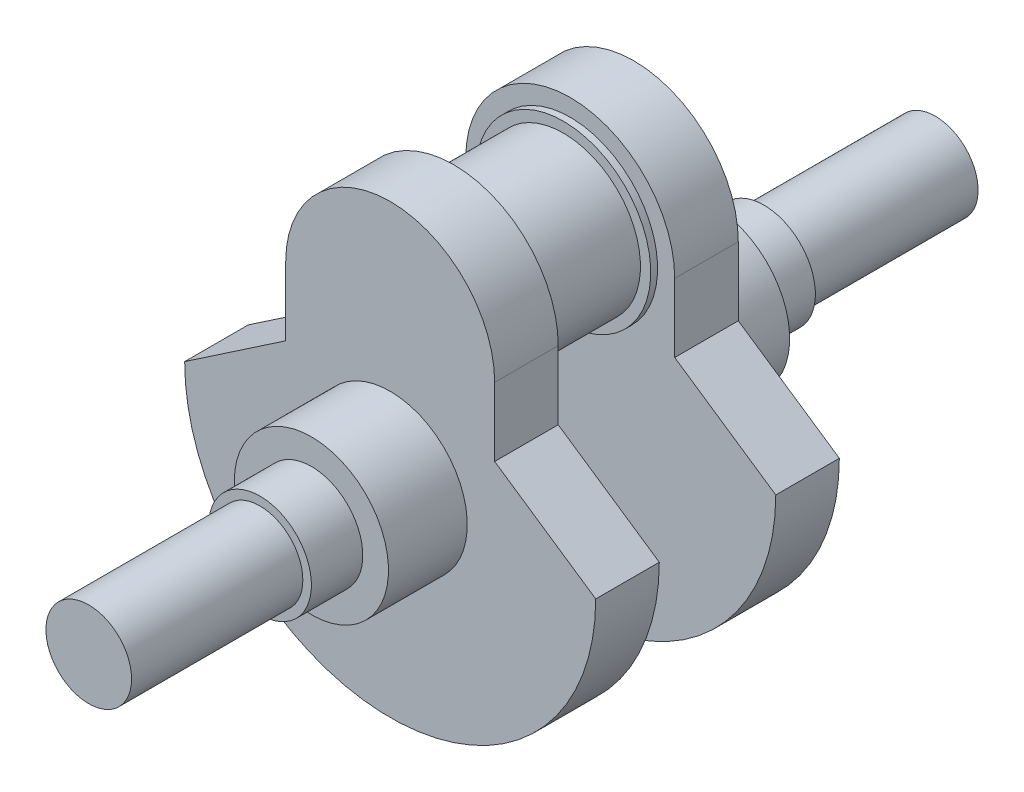
ISO-10303-21;
HEADER;
FILE_DESCRIPTION(('STEP AP214'),'2;1');
FILE_NAME('part.step','',(''),(''),'','','');
FILE_SCHEMA(('AUTOMOTIVE_DESIGN { 1 0 10303 214 1 1 1 1 }'));
ENDSEC;
DATA;
#1=APPLICATION_CONTEXT('core data for automotive mechanical design processes');
#2=APPLICATION_PROTOCOL_DEFINITION('international standard','automotive_design',2000,#1);
#3=PRODUCT_CONTEXT('',#1,'mechanical');
#4=PRODUCT('Part','Part','',(#3));
#5=PRODUCT_RELATED_PRODUCT_CATEGORY('part','',(#4));
#6=PRODUCT_DEFINITION_FORMATION('','',#4);
#7=PRODUCT_DEFINITION_CONTEXT('part definition',#1,'design');
#8=PRODUCT_DEFINITION('design','',#6,#7);
#9=PRODUCT_DEFINITION_SHAPE('','',#8);
#10=(LENGTH_UNIT() NAMED_UNIT(*) SI_UNIT(.MILLI.,.METRE.));
#11=(NAMED_UNIT(*) PLANE_ANGLE_UNIT() SI_UNIT($,.RADIAN.));
#12=(NAMED_UNIT(*) SI_UNIT($,.STERADIAN.) SOLID_ANGLE_UNIT());
#13=UNCERTAINTY_MEASURE_WITH_UNIT(LENGTH_MEASURE(1.E-05),#10,'distance_accuracy_value','');
#14=(GEOMETRIC_REPRESENTATION_CONTEXT(3) GLOBAL_UNCERTAINTY_ASSIGNED_CONTEXT((#13)) GLOBAL_UNIT_ASSIGNED_CONTEXT((#10,
#11,#12)) REPRESENTATION_CONTEXT('',''));
#15=CARTESIAN_POINT('',(0.,0.,0.));
#16=DIRECTION('',(0.,0.,1.));
#17=DIRECTION('',(1.,0.,0.));
#18=AXIS2_PLACEMENT_3D('',#15,#16,#17);
#19=CARTESIAN_POINT('',(0.,0.,-88.));
#20=DIRECTION('',(0.,0.,1.));
#21=DIRECTION('',(1.,0.,0.));
#22=AXIS2_PLACEMENT_3D('',#19,#20,#21);
#23=CYLINDRICAL_SURFACE('',#22,22.5);
#24=CARTESIAN_POINT('',(0.,0.,-65.));
#25=DIRECTION('',(0.,0.,-1.));
#26=DIRECTION('',(-1.,0.,0.));
#27=AXIS2_PLACEMENT_3D('',#24,#25,#26);
#28=CIRCLE('',#27,22.5);
#29=CARTESIAN_POINT('',(-22.5,0.,-65.));
#30=VERTEX_POINT('',#29);
#31=EDGE_CURVE('E144',#30,#30,#28,.T.);
#32=ORIENTED_EDGE('',*,*,#31,.T.);
#33=EDGE_LOOP('',(#32));
#34=FACE_BOUND('',#33,.T.);
#35=CARTESIAN_POINT('',(0.,0.,-88.));
#36=DIRECTION('',(0.,0.,-1.));
#37=DIRECTION('',(-1.,0.,0.));
#38=AXIS2_PLACEMENT_3D('',#35,#36,#37);
#39=CIRCLE('',#38,22.5);
#40=CARTESIAN_POINT('',(-22.5,0.,-88.));
#41=VERTEX_POINT('',#40);
#42=EDGE_CURVE('E53',#41,#41,#39,.T.);
#43=ORIENTED_EDGE('',*,*,#42,.F.);
#44=EDGE_LOOP('',(#43));
#45=FACE_BOUND('',#44,.T.);
#46=ADVANCED_FACE('F49',(#34,#45),#23,.T.);
#47=CARTESIAN_POINT('',(0.,0.,-50.));
#48=DIRECTION('',(0.,0.,1.));
#49=DIRECTION('',(1.,0.,0.));
#50=AXIS2_PLACEMENT_3D('',#47,#48,#49);
#51=CYLINDRICAL_SURFACE('',#50,12.5);
#52=CARTESIAN_POINT('',(0.,0.,-50.));
#53=DIRECTION('',(0.,0.,1.));
#54=DIRECTION('',(1.,0.,0.));
#55=AXIS2_PLACEMENT_3D('',#52,#53,#54);
#56=CIRCLE('',#55,12.5);
#57=CARTESIAN_POINT('',(12.5,0.,-50.));
#58=VERTEX_POINT('',#57);
#59=EDGE_CURVE('E151',#58,#58,#56,.T.);
#60=ORIENTED_EDGE('',*,*,#59,.T.);
#61=EDGE_LOOP('',(#60));
#62=FACE_BOUND('',#61,.T.);
#63=CARTESIAN_POINT('',(0.,0.,0.));
#64=DIRECTION('',(0.,0.,1.));
#65=DIRECTION('',(1.,0.,0.));
#66=AXIS2_PLACEMENT_3D('',#63,#64,#65);
#67=CIRCLE('',#66,12.5);
#68=CARTESIAN_POINT('',(12.5,0.,0.));
#69=VERTEX_POINT('',#68);
#70=EDGE_CURVE('E155',#69,#69,#67,.T.);
#71=ORIENTED_EDGE('',*,*,#70,.F.);
#72=EDGE_LOOP('',(#71));
#73=FACE_BOUND('',#72,.T.);
#74=ADVANCED_FACE('F51',(#62,#73),#51,.T.);
#75=CARTESIAN_POINT('',(0.,0.,0.));
#76=DIRECTION('',(0.,0.,1.));
#77=DIRECTION('',(1.,0.,0.));
#78=AXIS2_PLACEMENT_3D('',#75,#76,#77);
#79=PLANE('',#78);
#80=ORIENTED_EDGE('',*,*,#70,.T.);
#81=EDGE_LOOP('',(#80));
#82=FACE_BOUND('',#81,.T.);
#83=ADVANCED_FACE('F211',(#82),#79,.T.);
#84=CARTESIAN_POINT('',(0.,0.,-65.));
#85=DIRECTION('',(0.,0.,1.));
#86=DIRECTION('',(1.,0.,0.));
#87=AXIS2_PLACEMENT_3D('',#84,#85,#86);
#88=CYLINDRICAL_SURFACE('',#87,15.);
#89=CARTESIAN_POINT('',(0.,0.,-65.));
#90=DIRECTION('',(0.,0.,-1.));
#91=DIRECTION('',(-1.,0.,0.));
#92=AXIS2_PLACEMENT_3D('',#89,#90,#91);
#93=CIRCLE('',#92,15.);
#94=CARTESIAN_POINT('',(-15.,0.,-65.));
#95=VERTEX_POINT('',#94);
#96=EDGE_CURVE('E148',#95,#95,#93,.T.);
#97=ORIENTED_EDGE('',*,*,#96,.F.);
#98=EDGE_LOOP('',(#97));
#99=FACE_BOUND('',#98,.T.);
#100=CARTESIAN_POINT('',(0.,0.,-50.));
#101=DIRECTION('',(0.,0.,-1.));
#102=DIRECTION('',(-1.,0.,0.));
#103=AXIS2_PLACEMENT_3D('',#100,#101,#102);
#104=CIRCLE('',#103,15.);
#105=CARTESIAN_POINT('',(-15.,0.,-50.));
#106=VERTEX_POINT('',#105);
#107=EDGE_CURVE('E147',#106,#106,#104,.T.);
#108=ORIENTED_EDGE('',*,*,#107,.T.);
#109=EDGE_LOOP('',(#108));
#110=FACE_BOUND('',#109,.T.);
#111=ADVANCED_FACE('F221',(#99,#110),#88,.T.);
#112=CARTESIAN_POINT('',(0.,0.,-50.));
#113=DIRECTION('',(0.,0.,-1.));
#114=DIRECTION('',(-1.,0.,0.));
#115=AXIS2_PLACEMENT_3D('',#112,#113,#114);
#116=PLANE('',#115);
#117=ORIENTED_EDGE('',*,*,#59,.F.);
#118=EDGE_LOOP('',(#117));
#119=FACE_BOUND('',#118,.T.);
#120=ORIENTED_EDGE('',*,*,#107,.F.);
#121=EDGE_LOOP('',(#120));
#122=FACE_BOUND('',#121,.T.);
#123=ADVANCED_FACE('F218',(#119,#122),#116,.F.);
#124=CARTESIAN_POINT('',(0.,0.,-65.));
#125=DIRECTION('',(0.,0.,-1.));
#126=DIRECTION('',(-1.,0.,0.));
#127=AXIS2_PLACEMENT_3D('',#124,#125,#126);
#128=PLANE('',#127);
#129=ORIENTED_EDGE('',*,*,#96,.T.);
#130=EDGE_LOOP('',(#129));
#131=FACE_BOUND('',#130,.T.);
#132=ORIENTED_EDGE('',*,*,#31,.F.);
#133=EDGE_LOOP('',(#132));
#134=FACE_BOUND('',#133,.T.);
#135=ADVANCED_FACE('F216',(#131,#134),#128,.F.);
#136=CARTESIAN_POINT('',(-30.5,0.,-106.56));
#137=DIRECTION('',(-1.,0.,0.));
#138=DIRECTION('',(0.,0.,1.));
#139=AXIS2_PLACEMENT_3D('',#136,#137,#138);
#140=PLANE('',#139);
#141=DIRECTION('',(0.,-1.,0.));
#142=VECTOR('',#141,1.);
#143=CARTESIAN_POINT('',(-30.5,0.,-88.));
#144=LINE('',#143,#142);
#145=CARTESIAN_POINT('',(-30.5,40.,-88.));
#146=VERTEX_POINT('',#145);
#147=CARTESIAN_POINT('',(-30.5,20.,-88.));
#148=VERTEX_POINT('',#147);
#149=EDGE_CURVE('E181',#146,#148,#144,.T.);
#150=ORIENTED_EDGE('',*,*,#149,.F.);
#151=DIRECTION('',(0.,0.,1.));
#152=VECTOR('',#151,1.);
#153=CARTESIAN_POINT('',(-30.5,40.,-106.56));
#154=LINE('',#153,#152);
#155=CARTESIAN_POINT('',(-30.5,40.,-106.56));
#156=VERTEX_POINT('',#155);
#157=EDGE_CURVE('E99',#156,#146,#154,.T.);
#158=ORIENTED_EDGE('',*,*,#157,.F.);
#159=DIRECTION('',(0.,-1.,0.));
#160=VECTOR('',#159,1.);
#161=CARTESIAN_POINT('',(-30.5,0.,-106.56));
#162=LINE('',#161,#160);
#163=CARTESIAN_POINT('',(-30.5,20.,-106.56));
#164=VERTEX_POINT('',#163);
#165=EDGE_CURVE('E174',#156,#164,#162,.T.);
#166=ORIENTED_EDGE('',*,*,#165,.T.);
#167=DIRECTION('',(0.,0.,1.));
#168=VECTOR('',#167,1.);
#169=CARTESIAN_POINT('',(-30.5,20.,-106.56));
#170=LINE('',#169,#168);
#171=EDGE_CURVE('E68',#164,#148,#170,.T.);
#172=ORIENTED_EDGE('',*,*,#171,.T.);
#173=EDGE_LOOP('',(#150,#158,#166,#172));
#174=FACE_BOUND('',#173,.T.);
#175=ADVANCED_FACE('F244',(#174),#140,.T.);
#176=CARTESIAN_POINT('',(0.,40.,-106.56));
#177=DIRECTION('',(0.,0.,1.));
#178=DIRECTION('',(1.,0.,0.));
#179=AXIS2_PLACEMENT_3D('',#176,#177,#178);
#180=CYLINDRICAL_SURFACE('',#179,30.5);
#181=CARTESIAN_POINT('',(0.,40.,-88.));
#182=DIRECTION('',(0.,0.,-1.));
#183=DIRECTION('',(-1.,0.,0.));
#184=AXIS2_PLACEMENT_3D('',#181,#182,#183);
#185=CIRCLE('',#184,30.5);
#186=CARTESIAN_POINT('',(30.5,40.,-88.));
#187=VERTEX_POINT('',#186);
#188=EDGE_CURVE('E183',#146,#187,#185,.T.);
#189=ORIENTED_EDGE('',*,*,#188,.T.);
#190=DIRECTION('',(0.,0.,1.));
#191=VECTOR('',#190,1.);
#192=CARTESIAN_POINT('',(30.5,40.,-106.56));
#193=LINE('',#192,#191);
#194=CARTESIAN_POINT('',(30.5,40.,-106.56));
#195=VERTEX_POINT('',#194);
#196=EDGE_CURVE('E136',#195,#187,#193,.T.);
#197=ORIENTED_EDGE('',*,*,#196,.F.);
#198=CARTESIAN_POINT('',(0.,40.,-106.56));
#199=DIRECTION('',(0.,0.,-1.));
#200=DIRECTION('',(-1.,0.,0.));
#201=AXIS2_PLACEMENT_3D('',#198,#199,#200);
#202=CIRCLE('',#201,30.5);
#203=EDGE_CURVE('E176',#156,#195,#202,.T.);
#204=ORIENTED_EDGE('',*,*,#203,.F.);
#205=ORIENTED_EDGE('',*,*,#157,.T.);
#206=EDGE_LOOP('',(#189,#197,#204,#205));
#207=FACE_BOUND('',#206,.T.);
#208=ADVANCED_FACE('F251',(#207),#180,.T.);
#209=CARTESIAN_POINT('',(30.5,0.,-106.56));
#210=DIRECTION('',(-1.,0.,0.));
#211=DIRECTION('',(0.,-1.,0.));
#212=AXIS2_PLACEMENT_3D('',#209,#210,#211);
#213=PLANE('',#212);
#214=DIRECTION('',(0.,-1.,0.));
#215=VECTOR('',#214,1.);
#216=CARTESIAN_POINT('',(30.5,0.,-88.));
#217=LINE('',#216,#215);
#218=CARTESIAN_POINT('',(30.5,20.,-88.));
#219=VERTEX_POINT('',#218);
#220=EDGE_CURVE('E186',#187,#219,#217,.T.);
#221=ORIENTED_EDGE('',*,*,#220,.T.);
#222=DIRECTION('',(0.,0.,1.));
#223=VECTOR('',#222,1.);
#224=CARTESIAN_POINT('',(30.5,20.,-106.56));
#225=LINE('',#224,#223);
#226=CARTESIAN_POINT('',(30.5,20.,-106.56));
#227=VERTEX_POINT('',#226);
#228=EDGE_CURVE('E134',#227,#219,#225,.T.);
#229=ORIENTED_EDGE('',*,*,#228,.F.);
#230=DIRECTION('',(0.,-1.,0.));
#231=VECTOR('',#230,1.);
#232=CARTESIAN_POINT('',(30.5,0.,-106.56));
#233=LINE('',#232,#231);
#234=EDGE_CURVE('E127',#195,#227,#233,.T.);
#235=ORIENTED_EDGE('',*,*,#234,.F.);
#236=ORIENTED_EDGE('',*,*,#196,.T.);
#237=EDGE_LOOP('',(#221,#229,#235,#236));
#238=FACE_BOUND('',#237,.T.);
#239=ADVANCED_FACE('F258',(#238),#213,.F.);
#240=CARTESIAN_POINT('',(18.8964507759631,27.8680132286295,-106.56));
#241=DIRECTION('',(-0.561216953061736,-0.827668733006208,0.));
#242=DIRECTION('',(0.827668733006208,-0.561216953061736,0.));
#243=AXIS2_PLACEMENT_3D('',#240,#241,#242);
#244=PLANE('',#243);
#245=DIRECTION('',(0.827668733006208,-0.561216953061736,0.));
#246=VECTOR('',#245,1.);
#247=CARTESIAN_POINT('',(18.8964507759631,27.8680132286295,-88.));
#248=LINE('',#247,#246);
#249=CARTESIAN_POINT('',(59.9999999224164,-0.0030512348178878,-88.));
#250=VERTEX_POINT('',#249);
#251=EDGE_CURVE('E133',#219,#250,#248,.T.);
#252=ORIENTED_EDGE('',*,*,#251,.T.);
#253=DIRECTION('',(0.,0.,1.));
#254=VECTOR('',#253,1.);
#255=CARTESIAN_POINT('',(59.9999999224164,-0.0030512348178878,-106.56));
#256=LINE('',#255,#254);
#257=CARTESIAN_POINT('',(59.9999999224164,-0.0030512348178878,-106.56));
#258=VERTEX_POINT('',#257);
#259=EDGE_CURVE('E116',#258,#250,#256,.T.);
#260=ORIENTED_EDGE('',*,*,#259,.F.);
#261=DIRECTION('',(0.827668733006208,-0.561216953061736,0.));
#262=VECTOR('',#261,1.);
#263=CARTESIAN_POINT('',(18.8964507759631,27.8680132286295,-106.56));
#264=LINE('',#263,#262);
#265=EDGE_CURVE('E121',#227,#258,#264,.T.);
#266=ORIENTED_EDGE('',*,*,#265,.F.);
#267=ORIENTED_EDGE('',*,*,#228,.T.);
#268=EDGE_LOOP('',(#252,#260,#266,#267));
#269=FACE_BOUND('',#268,.T.);
#270=ADVANCED_FACE('F132',(#269),#244,.F.);
#271=CARTESIAN_POINT('',(0.,0.,-106.56));
#272=DIRECTION('',(0.,0.,1.));
#273=DIRECTION('',(1.,0.,0.));
#274=AXIS2_PLACEMENT_3D('',#271,#272,#273);
#275=CYLINDRICAL_SURFACE('',#274,60.);
#276=CARTESIAN_POINT('',(0.,0.,-88.));
#277=DIRECTION('',(0.,0.,-1.));
#278=DIRECTION('',(-1.,0.,0.));
#279=AXIS2_PLACEMENT_3D('',#276,#277,#278);
#280=CIRCLE('',#279,60.);
#281=CARTESIAN_POINT('',(-60.,0.,-88.));
#282=VERTEX_POINT('',#281);
#283=EDGE_CURVE('E190',#250,#282,#280,.T.);
#284=ORIENTED_EDGE('',*,*,#283,.T.);
#285=DIRECTION('',(0.,0.,1.));
#286=VECTOR('',#285,1.);
#287=CARTESIAN_POINT('',(-60.,0.,-106.56));
#288=LINE('',#287,#286);
#289=CARTESIAN_POINT('',(-60.,0.,-106.56));
#290=VERTEX_POINT('',#289);
#291=EDGE_CURVE('E90',#290,#282,#288,.T.);
#292=ORIENTED_EDGE('',*,*,#291,.F.);
#293=CARTESIAN_POINT('',(0.,0.,-106.56));
#294=DIRECTION('',(0.,0.,-1.));
#295=DIRECTION('',(-1.,0.,0.));
#296=AXIS2_PLACEMENT_3D('',#293,#294,#295);
#297=CIRCLE('',#296,60.);
#298=EDGE_CURVE('E112',#258,#290,#297,.T.);
#299=ORIENTED_EDGE('',*,*,#298,.F.);
#300=ORIENTED_EDGE('',*,*,#259,.T.);
#301=EDGE_LOOP('',(#284,#292,#299,#300));
#302=FACE_BOUND('',#301,.T.);
#303=ADVANCED_FACE('F114',(#302),#275,.T.);
#304=CARTESIAN_POINT('',(-18.8939185199764,27.8685298169652,-106.56));
#305=DIRECTION('',(-0.56115830386764,0.827708498204769,0.));
#306=DIRECTION('',(-0.827708498204769,-0.56115830386764,0.));
#307=AXIS2_PLACEMENT_3D('',#304,#305,#306);
#308=PLANE('',#307);
#309=DIRECTION('',(-0.827708498204769,-0.56115830386764,0.));
#310=VECTOR('',#309,1.);
#311=CARTESIAN_POINT('',(-18.8939185199764,27.8685298169652,-88.));
#312=LINE('',#311,#310);
#313=EDGE_CURVE('E177',#148,#282,#312,.T.);
#314=ORIENTED_EDGE('',*,*,#313,.F.);
#315=ORIENTED_EDGE('',*,*,#171,.F.);
#316=DIRECTION('',(-0.827708498204769,-0.56115830386764,0.));
#317=VECTOR('',#316,1.);
#318=CARTESIAN_POINT('',(-18.8939185199764,27.8685298169652,-106.56));
#319=LINE('',#318,#317);
#320=EDGE_CURVE('E120',#164,#290,#319,.T.);
#321=ORIENTED_EDGE('',*,*,#320,.T.);
#322=ORIENTED_EDGE('',*,*,#291,.T.);
#323=EDGE_LOOP('',(#314,#315,#321,#322));
#324=FACE_BOUND('',#323,.T.);
#325=ADVANCED_FACE('F196',(#324),#308,.T.);
#326=CARTESIAN_POINT('',(0.,0.,-88.));
#327=DIRECTION('',(0.,0.,-1.));
#328=DIRECTION('',(-1.,0.,0.));
#329=AXIS2_PLACEMENT_3D('',#326,#327,#328);
#330=PLANE('',#329);
#331=ORIENTED_EDGE('',*,*,#42,.T.);
#332=EDGE_LOOP('',(#331));
#333=FACE_BOUND('',#332,.T.);
#334=ORIENTED_EDGE('',*,*,#149,.T.);
#335=ORIENTED_EDGE('',*,*,#313,.T.);
#336=ORIENTED_EDGE('',*,*,#283,.F.);
#337=ORIENTED_EDGE('',*,*,#251,.F.);
#338=ORIENTED_EDGE('',*,*,#220,.F.);
#339=ORIENTED_EDGE('',*,*,#188,.F.);
#340=EDGE_LOOP('',(#334,#335,#336,#337,#338,#339));
#341=FACE_BOUND('',#340,.T.);
#342=ADVANCED_FACE('F194',(#333,#341),#330,.F.);
#343=CARTESIAN_POINT('',(0.,0.,-106.56));
#344=DIRECTION('',(0.,0.,-1.));
#345=DIRECTION('',(-1.,0.,0.));
#346=AXIS2_PLACEMENT_3D('',#343,#344,#345);
#347=PLANE('',#346);
#348=CARTESIAN_POINT('',(0.,40.,-106.56));
#349=DIRECTION('',(0.,0.,-1.));
#350=DIRECTION('',(-1.,0.,0.));
#351=AXIS2_PLACEMENT_3D('',#348,#349,#350);
#352=CIRCLE('',#351,25.5);
#353=CARTESIAN_POINT('',(-25.5,40.,-106.56));
#354=VERTEX_POINT('',#353);
#355=EDGE_CURVE('E160',#354,#354,#352,.T.);
#356=ORIENTED_EDGE('',*,*,#355,.F.);
#357=EDGE_LOOP('',(#356));
#358=FACE_BOUND('',#357,.T.);
#359=ORIENTED_EDGE('',*,*,#165,.F.);
#360=ORIENTED_EDGE('',*,*,#203,.T.);
#361=ORIENTED_EDGE('',*,*,#234,.T.);
#362=ORIENTED_EDGE('',*,*,#265,.T.);
#363=ORIENTED_EDGE('',*,*,#298,.T.);
#364=ORIENTED_EDGE('',*,*,#320,.F.);
#365=EDGE_LOOP('',(#359,#360,#361,#362,#363,#364));
#366=FACE_BOUND('',#365,.T.);
#367=ADVANCED_FACE('F125',(#358,#366),#347,.T.);
#368=CARTESIAN_POINT('',(0.,40.,-108.56));
#369=DIRECTION('',(0.,0.,1.));
#370=DIRECTION('',(1.,0.,0.));
#371=AXIS2_PLACEMENT_3D('',#368,#369,#370);
#372=CYLINDRICAL_SURFACE('',#371,25.5);
#373=CARTESIAN_POINT('',(0.,40.,-108.56));
#374=DIRECTION('',(0.,0.,-1.));
#375=DIRECTION('',(-1.,0.,0.));
#376=AXIS2_PLACEMENT_3D('',#373,#374,#375);
#377=CIRCLE('',#376,25.5);
#378=CARTESIAN_POINT('',(-25.5,40.,-108.56));
#379=VERTEX_POINT('',#378);
#380=EDGE_CURVE('E173',#379,#379,#377,.T.);
#381=ORIENTED_EDGE('',*,*,#380,.F.);
#382=EDGE_LOOP('',(#381));
#383=FACE_BOUND('',#382,.T.);
#384=ORIENTED_EDGE('',*,*,#355,.T.);
#385=EDGE_LOOP('',(#384));
#386=FACE_BOUND('',#385,.T.);
#387=ADVANCED_FACE('F296',(#383,#386),#372,.T.);
#388=CARTESIAN_POINT('',(0.,40.,-108.56));
#389=DIRECTION('',(0.,0.,-1.));
#390=DIRECTION('',(-1.,0.,0.));
#391=AXIS2_PLACEMENT_3D('',#388,#389,#390);
#392=PLANE('',#391);
#393=CARTESIAN_POINT('',(0.,40.,-108.56));
#394=DIRECTION('',(0.,0.,-1.));
#395=DIRECTION('',(-1.,0.,0.));
#396=AXIS2_PLACEMENT_3D('',#393,#394,#395);
#397=CIRCLE('',#396,22.5);
#398=CARTESIAN_POINT('',(-22.5,40.,-108.56));
#399=VERTEX_POINT('',#398);
#400=EDGE_CURVE('E164',#399,#399,#397,.T.);
#401=ORIENTED_EDGE('',*,*,#400,.F.);
#402=EDGE_LOOP('',(#401));
#403=FACE_BOUND('',#402,.T.);
#404=ORIENTED_EDGE('',*,*,#380,.T.);
#405=EDGE_LOOP('',(#404));
#406=FACE_BOUND('',#405,.T.);
#407=ADVANCED_FACE('F305',(#403,#406),#392,.T.);
#408=CARTESIAN_POINT('',(0.,40.,-138.56));
#409=DIRECTION('',(0.,0.,1.));
#410=DIRECTION('',(1.,0.,0.));
#411=AXIS2_PLACEMENT_3D('',#408,#409,#410);
#412=CYLINDRICAL_SURFACE('',#411,22.5);
#413=CARTESIAN_POINT('',(0.,40.,-138.56));
#414=DIRECTION('',(0.,0.,-1.));
#415=DIRECTION('',(-1.,0.,0.));
#416=AXIS2_PLACEMENT_3D('',#413,#414,#415);
#417=CIRCLE('',#416,22.5);
#418=CARTESIAN_POINT('',(-22.5,40.,-138.56));
#419=VERTEX_POINT('',#418);
#420=EDGE_CURVE('E743',#419,#419,#417,.T.);
#421=ORIENTED_EDGE('',*,*,#420,.F.);
#422=EDGE_LOOP('',(#421));
#423=FACE_BOUND('',#422,.T.);
#424=ORIENTED_EDGE('',*,*,#400,.T.);
#425=EDGE_LOOP('',(#424));
#426=FACE_BOUND('',#425,.T.);
#427=ADVANCED_FACE('F315',(#423,#426),#412,.T.);
#428=CARTESIAN_POINT('',(0.,40.,-140.56));
#429=DIRECTION('',(0.,0.,1.));
#430=DIRECTION('',(1.,0.,0.));
#431=AXIS2_PLACEMENT_3D('',#428,#429,#430);
#432=CYLINDRICAL_SURFACE('',#431,25.5);
#433=CARTESIAN_POINT('',(0.,40.,-140.56));
#434=DIRECTION('',(0.,0.,-1.));
#435=DIRECTION('',(-1.,0.,0.));
#436=AXIS2_PLACEMENT_3D('',#433,#434,#435);
#437=CIRCLE('',#436,25.5);
#438=CARTESIAN_POINT('',(-25.5,40.,-140.56));
#439=VERTEX_POINT('',#438);
#440=EDGE_CURVE('E740',#439,#439,#437,.T.);
#441=ORIENTED_EDGE('',*,*,#440,.F.);
#442=EDGE_LOOP('',(#441));
#443=FACE_BOUND('',#442,.T.);
#444=CARTESIAN_POINT('',(0.,40.,-138.56));
#445=DIRECTION('',(0.,0.,-1.));
#446=DIRECTION('',(-1.,0.,0.));
#447=AXIS2_PLACEMENT_3D('',#444,#445,#446);
#448=CIRCLE('',#447,25.5);
#449=CARTESIAN_POINT('',(-25.5,40.,-138.56));
#450=VERTEX_POINT('',#449);
#451=EDGE_CURVE('E739',#450,#450,#448,.T.);
#452=ORIENTED_EDGE('',*,*,#451,.T.);
#453=EDGE_LOOP('',(#452));
#454=FACE_BOUND('',#453,.T.);
#455=ADVANCED_FACE('F325',(#443,#454),#432,.T.);
#456=CARTESIAN_POINT('',(0.,40.,-138.56));
#457=DIRECTION('',(0.,0.,-1.));
#458=DIRECTION('',(-1.,0.,0.));
#459=AXIS2_PLACEMENT_3D('',#456,#457,#458);
#460=PLANE('',#459);
#461=ORIENTED_EDGE('',*,*,#420,.T.);
#462=EDGE_LOOP('',(#461));
#463=FACE_BOUND('',#462,.T.);
#464=ORIENTED_EDGE('',*,*,#451,.F.);
#465=EDGE_LOOP('',(#464));
#466=FACE_BOUND('',#465,.T.);
#467=ADVANCED_FACE('F335',(#463,#466),#460,.F.);
#468=CARTESIAN_POINT('',(0.,0.,-159.12));
#469=DIRECTION('',(0.,0.,1.));
#470=DIRECTION('',(1.,0.,0.));
#471=AXIS2_PLACEMENT_3D('',#468,#469,#470);
#472=CYLINDRICAL_SURFACE('',#471,60.);
#473=CARTESIAN_POINT('',(0.,0.,-140.56));
#474=DIRECTION('',(0.,0.,-1.));
#475=DIRECTION('',(-1.,0.,0.));
#476=AXIS2_PLACEMENT_3D('',#473,#474,#475);
#477=CIRCLE('',#476,60.);
#478=CARTESIAN_POINT('',(60.,0.,-140.56));
#479=VERTEX_POINT('',#478);
#480=CARTESIAN_POINT('',(-60.,0.,-140.56));
#481=VERTEX_POINT('',#480);
#482=EDGE_CURVE('E683',#479,#481,#477,.T.);
#483=ORIENTED_EDGE('',*,*,#482,.T.);
#484=DIRECTION('',(0.,0.,1.));
#485=VECTOR('',#484,1.);
#486=CARTESIAN_POINT('',(-60.,0.,-159.12));
#487=LINE('',#486,#485);
#488=CARTESIAN_POINT('',(-60.,0.,-159.12));
#489=VERTEX_POINT('',#488);
#490=EDGE_CURVE('E736',#489,#481,#487,.T.);
#491=ORIENTED_EDGE('',*,*,#490,.F.);
#492=CARTESIAN_POINT('',(0.,0.,-159.12));
#493=DIRECTION('',(0.,0.,-1.));
#494=DIRECTION('',(-1.,0.,0.));
#495=AXIS2_PLACEMENT_3D('',#492,#493,#494);
#496=CIRCLE('',#495,60.);
#497=CARTESIAN_POINT('',(60.,0.,-159.12));
#498=VERTEX_POINT('',#497);
#499=EDGE_CURVE('E686',#498,#489,#496,.T.);
#500=ORIENTED_EDGE('',*,*,#499,.F.);
#501=DIRECTION('',(0.,0.,1.));
#502=VECTOR('',#501,1.);
#503=CARTESIAN_POINT('',(60.,0.,-159.12));
#504=LINE('',#503,#502);
#505=EDGE_CURVE('E705',#498,#479,#504,.T.);
#506=ORIENTED_EDGE('',*,*,#505,.T.);
#507=EDGE_LOOP('',(#483,#491,#500,#506));
#508=FACE_BOUND('',#507,.T.);
#509=ADVANCED_FACE('F345',(#508),#472,.T.);
#510=CARTESIAN_POINT('',(-30.5,20.,-159.12));
#511=DIRECTION('',(0.56115830386764,-0.827708498204769,0.));
#512=DIRECTION('',(0.827708498204769,0.56115830386764,0.));
#513=AXIS2_PLACEMENT_3D('',#510,#511,#512);
#514=PLANE('',#513);
#515=DIRECTION('',(0.827708498204769,0.56115830386764,0.));
#516=VECTOR('',#515,1.);
#517=CARTESIAN_POINT('',(-30.5,20.,-140.56));
#518=LINE('',#517,#516);
#519=CARTESIAN_POINT('',(-30.5,20.,-140.56));
#520=VERTEX_POINT('',#519);
#521=EDGE_CURVE('E708',#481,#520,#518,.T.);
#522=ORIENTED_EDGE('',*,*,#521,.T.);
#523=DIRECTION('',(0.,0.,1.));
#524=VECTOR('',#523,1.);
#525=CARTESIAN_POINT('',(-30.5,20.,-159.12));
#526=LINE('',#525,#524);
#527=CARTESIAN_POINT('',(-30.5,20.,-159.12));
#528=VERTEX_POINT('',#527);
#529=EDGE_CURVE('E733',#528,#520,#526,.T.);
#530=ORIENTED_EDGE('',*,*,#529,.F.);
#531=DIRECTION('',(0.827708498204769,0.56115830386764,0.));
#532=VECTOR('',#531,1.);
#533=CARTESIAN_POINT('',(-30.5,20.,-159.12));
#534=LINE('',#533,#532);
#535=EDGE_CURVE('E689',#489,#528,#534,.T.);
#536=ORIENTED_EDGE('',*,*,#535,.F.);
#537=ORIENTED_EDGE('',*,*,#490,.T.);
#538=EDGE_LOOP('',(#522,#530,#536,#537));
#539=FACE_BOUND('',#538,.T.);
#540=ADVANCED_FACE('F355',(#539),#514,.F.);
#541=CARTESIAN_POINT('',(-30.5,40.,-159.12));
#542=DIRECTION('',(1.,0.,0.));
#543=DIRECTION('',(0.,1.,0.));
#544=AXIS2_PLACEMENT_3D('',#541,#542,#543);
#545=PLANE('',#544);
#546=DIRECTION('',(0.,1.,0.));
#547=VECTOR('',#546,1.);
#548=CARTESIAN_POINT('',(-30.5,40.,-140.56));
#549=LINE('',#548,#547);
#550=CARTESIAN_POINT('',(-30.5,40.,-140.56));
#551=VERTEX_POINT('',#550);
#552=EDGE_CURVE('E711',#520,#551,#549,.T.);
#553=ORIENTED_EDGE('',*,*,#552,.T.);
#554=DIRECTION('',(0.,0.,1.));
#555=VECTOR('',#554,1.);
#556=CARTESIAN_POINT('',(-30.5,40.,-159.12));
#557=LINE('',#556,#555);
#558=CARTESIAN_POINT('',(-30.5,40.,-159.12));
#559=VERTEX_POINT('',#558);
#560=EDGE_CURVE('E730',#559,#551,#557,.T.);
#561=ORIENTED_EDGE('',*,*,#560,.F.);
#562=DIRECTION('',(0.,1.,0.));
#563=VECTOR('',#562,1.);
#564=CARTESIAN_POINT('',(-30.5,40.,-159.12));
#565=LINE('',#564,#563);
#566=EDGE_CURVE('E693',#528,#559,#565,.T.);
#567=ORIENTED_EDGE('',*,*,#566,.F.);
#568=ORIENTED_EDGE('',*,*,#529,.T.);
#569=EDGE_LOOP('',(#553,#561,#567,#568));
#570=FACE_BOUND('',#569,.T.);
#571=ADVANCED_FACE('F365',(#570),#545,.F.);
#572=CARTESIAN_POINT('',(0.,40.,-159.12));
#573=DIRECTION('',(0.,0.,1.));
#574=DIRECTION('',(1.,0.,0.));
#575=AXIS2_PLACEMENT_3D('',#572,#573,#574);
#576=CYLINDRICAL_SURFACE('',#575,30.5);
#577=CARTESIAN_POINT('',(0.,40.,-140.56));
#578=DIRECTION('',(0.,0.,-1.));
#579=DIRECTION('',(-1.,0.,0.));
#580=AXIS2_PLACEMENT_3D('',#577,#578,#579);
#581=CIRCLE('',#580,30.5);
#582=CARTESIAN_POINT('',(30.5,40.,-140.56));
#583=VERTEX_POINT('',#582);
#584=EDGE_CURVE('E714',#551,#583,#581,.T.);
#585=ORIENTED_EDGE('',*,*,#584,.T.);
#586=DIRECTION('',(0.,0.,1.));
#587=VECTOR('',#586,1.);
#588=CARTESIAN_POINT('',(30.5,40.,-159.12));
#589=LINE('',#588,#587);
#590=CARTESIAN_POINT('',(30.5,40.,-159.12));
#591=VERTEX_POINT('',#590);
#592=EDGE_CURVE('E727',#591,#583,#589,.T.);
#593=ORIENTED_EDGE('',*,*,#592,.F.);
#594=CARTESIAN_POINT('',(0.,40.,-159.12));
#595=DIRECTION('',(0.,0.,-1.));
#596=DIRECTION('',(-1.,0.,0.));
#597=AXIS2_PLACEMENT_3D('',#594,#595,#596);
#598=CIRCLE('',#597,30.5);
#599=EDGE_CURVE('E696',#559,#591,#598,.T.);
#600=ORIENTED_EDGE('',*,*,#599,.F.);
#601=ORIENTED_EDGE('',*,*,#560,.T.);
#602=EDGE_LOOP('',(#585,#593,#600,#601));
#603=FACE_BOUND('',#602,.T.);
#604=ADVANCED_FACE('F375',(#603),#576,.T.);
#605=CARTESIAN_POINT('',(30.5,40.,-159.12));
#606=DIRECTION('',(-1.,0.,0.));
#607=DIRECTION('',(0.,-1.,0.));
#608=AXIS2_PLACEMENT_3D('',#605,#606,#607);
#609=PLANE('',#608);
#610=DIRECTION('',(0.,-1.,0.));
#611=VECTOR('',#610,1.);
#612=CARTESIAN_POINT('',(30.5,40.,-140.56));
#613=LINE('',#612,#611);
#614=CARTESIAN_POINT('',(30.5,20.,-140.56));
#615=VERTEX_POINT('',#614);
#616=EDGE_CURVE('E717',#583,#615,#613,.T.);
#617=ORIENTED_EDGE('',*,*,#616,.T.);
#618=DIRECTION('',(0.,0.,1.));
#619=VECTOR('',#618,1.);
#620=CARTESIAN_POINT('',(30.5,20.,-159.12));
#621=LINE('',#620,#619);
#622=CARTESIAN_POINT('',(30.5,20.,-159.12));
#623=VERTEX_POINT('',#622);
#624=EDGE_CURVE('E724',#623,#615,#621,.T.);
#625=ORIENTED_EDGE('',*,*,#624,.F.);
#626=DIRECTION('',(0.,-1.,0.));
#627=VECTOR('',#626,1.);
#628=CARTESIAN_POINT('',(30.5,40.,-159.12));
#629=LINE('',#628,#627);
#630=EDGE_CURVE('E699',#591,#623,#629,.T.);
#631=ORIENTED_EDGE('',*,*,#630,.F.);
#632=ORIENTED_EDGE('',*,*,#592,.T.);
#633=EDGE_LOOP('',(#617,#625,#631,#632));
#634=FACE_BOUND('',#633,.T.);
#635=ADVANCED_FACE('F385',(#634),#609,.F.);
#636=CARTESIAN_POINT('',(30.5,20.,-159.12));
#637=DIRECTION('',(-0.561158303867639,-0.827708498204769,0.));
#638=DIRECTION('',(0.827708498204769,-0.561158303867639,0.));
#639=AXIS2_PLACEMENT_3D('',#636,#637,#638);
#640=PLANE('',#639);
#641=DIRECTION('',(0.827708498204769,-0.561158303867639,0.));
#642=VECTOR('',#641,1.);
#643=CARTESIAN_POINT('',(30.5,20.,-140.56));
#644=LINE('',#643,#642);
#645=EDGE_CURVE('E690',#615,#479,#644,.T.);
#646=ORIENTED_EDGE('',*,*,#645,.T.);
#647=ORIENTED_EDGE('',*,*,#505,.F.);
#648=DIRECTION('',(0.827708498204769,-0.561158303867639,0.));
#649=VECTOR('',#648,1.);
#650=CARTESIAN_POINT('',(30.5,20.,-159.12));
#651=LINE('',#650,#649);
#652=EDGE_CURVE('E702',#623,#498,#651,.T.);
#653=ORIENTED_EDGE('',*,*,#652,.F.);
#654=ORIENTED_EDGE('',*,*,#624,.T.);
#655=EDGE_LOOP('',(#646,#647,#653,#654));
#656=FACE_BOUND('',#655,.T.);
#657=ADVANCED_FACE('F395',(#656),#640,.F.);
#658=CARTESIAN_POINT('',(0.,0.,-159.12));
#659=DIRECTION('',(0.,0.,-1.));
#660=DIRECTION('',(-1.,0.,0.));
#661=AXIS2_PLACEMENT_3D('',#658,#659,#660);
#662=PLANE('',#661);
#663=CARTESIAN_POINT('',(0.,0.,-159.12));
#664=DIRECTION('',(0.,0.,-1.));
#665=DIRECTION('',(-1.,0.,0.));
#666=AXIS2_PLACEMENT_3D('',#663,#664,#665);
#667=CIRCLE('',#666,22.5);
#668=CARTESIAN_POINT('',(-22.5,0.,-159.12));
#669=VERTEX_POINT('',#668);
#670=EDGE_CURVE('E169',#669,#669,#667,.T.);
#671=ORIENTED_EDGE('',*,*,#670,.F.);
#672=EDGE_LOOP('',(#671));
#673=FACE_BOUND('',#672,.T.);
#674=ORIENTED_EDGE('',*,*,#499,.T.);
#675=ORIENTED_EDGE('',*,*,#535,.T.);
#676=ORIENTED_EDGE('',*,*,#566,.T.);
#677=ORIENTED_EDGE('',*,*,#599,.T.);
#678=ORIENTED_EDGE('',*,*,#630,.T.);
#679=ORIENTED_EDGE('',*,*,#652,.T.);
#680=EDGE_LOOP('',(#674,#675,#676,#677,#678,#679));
#681=FACE_BOUND('',#680,.T.);
#682=ADVANCED_FACE('F405',(#673,#681),#662,.T.);
#683=CARTESIAN_POINT('',(0.,0.,-140.56));
#684=DIRECTION('',(0.,0.,-1.));
#685=DIRECTION('',(-1.,0.,0.));
#686=AXIS2_PLACEMENT_3D('',#683,#684,#685);
#687=PLANE('',#686);
#688=ORIENTED_EDGE('',*,*,#440,.T.);
#689=EDGE_LOOP('',(#688));
#690=FACE_BOUND('',#689,.T.);
#691=ORIENTED_EDGE('',*,*,#482,.F.);
#692=ORIENTED_EDGE('',*,*,#645,.F.);
#693=ORIENTED_EDGE('',*,*,#616,.F.);
#694=ORIENTED_EDGE('',*,*,#584,.F.);
#695=ORIENTED_EDGE('',*,*,#552,.F.);
#696=ORIENTED_EDGE('',*,*,#521,.F.);
#697=EDGE_LOOP('',(#691,#692,#693,#694,#695,#696));
#698=FACE_BOUND('',#697,.T.);
#699=ADVANCED_FACE('F415',(#690,#698),#687,.F.);
#700=CARTESIAN_POINT('',(0.,0.,-182.12));
#701=DIRECTION('',(0.,0.,1.));
#702=DIRECTION('',(1.,0.,0.));
#703=AXIS2_PLACEMENT_3D('',#700,#701,#702);
#704=CYLINDRICAL_SURFACE('',#703,22.5);
#705=CARTESIAN_POINT('',(0.,0.,-182.12));
#706=DIRECTION('',(0.,0.,-1.));
#707=DIRECTION('',(-1.,0.,0.));
#708=AXIS2_PLACEMENT_3D('',#705,#706,#707);
#709=CIRCLE('',#708,22.5);
#710=CARTESIAN_POINT('',(-22.5,0.,-182.12));
#711=VERTEX_POINT('',#710);
#712=EDGE_CURVE('E676',#711,#711,#709,.T.);
#713=ORIENTED_EDGE('',*,*,#712,.F.);
#714=EDGE_LOOP('',(#713));
#715=FACE_BOUND('',#714,.T.);
#716=ORIENTED_EDGE('',*,*,#670,.T.);
#717=EDGE_LOOP('',(#716));
#718=FACE_BOUND('',#717,.T.);
#719=ADVANCED_FACE('F425',(#715,#718),#704,.T.);
#720=CARTESIAN_POINT('',(0.,0.,-182.12));
#721=DIRECTION('',(0.,0.,-1.));
#722=DIRECTION('',(-1.,0.,0.));
#723=AXIS2_PLACEMENT_3D('',#720,#721,#722);
#724=PLANE('',#723);
#725=CARTESIAN_POINT('',(0.,0.,-182.12));
#726=DIRECTION('',(0.,0.,-1.));
#727=DIRECTION('',(-1.,0.,0.));
#728=AXIS2_PLACEMENT_3D('',#725,#726,#727);
#729=CIRCLE('',#728,15.);
#730=CARTESIAN_POINT('',(-15.,0.,-182.12));
#731=VERTEX_POINT('',#730);
#732=EDGE_CURVE('E59',#731,#731,#729,.T.);
#733=ORIENTED_EDGE('',*,*,#732,.F.);
#734=EDGE_LOOP('',(#733));
#735=FACE_BOUND('',#734,.T.);
#736=ORIENTED_EDGE('',*,*,#712,.T.);
#737=EDGE_LOOP('',(#736));
#738=FACE_BOUND('',#737,.T.);
#739=ADVANCED_FACE('F435',(#735,#738),#724,.T.);
#740=CARTESIAN_POINT('',(0.,0.,-197.12));
#741=DIRECTION('',(0.,0.,1.));
#742=DIRECTION('',(1.,0.,0.));
#743=AXIS2_PLACEMENT_3D('',#740,#741,#742);
#744=CYLINDRICAL_SURFACE('',#743,15.);
#745=CARTESIAN_POINT('',(0.,0.,-197.12));
#746=DIRECTION('',(0.,0.,-1.));
#747=DIRECTION('',(-1.,0.,0.));
#748=AXIS2_PLACEMENT_3D('',#745,#746,#747);
#749=CIRCLE('',#748,15.);
#750=CARTESIAN_POINT('',(-15.,0.,-197.12));
#751=VERTEX_POINT('',#750);
#752=EDGE_CURVE('E673',#751,#751,#749,.T.);
#753=ORIENTED_EDGE('',*,*,#752,.F.);
#754=EDGE_LOOP('',(#753));
#755=FACE_BOUND('',#754,.T.);
#756=ORIENTED_EDGE('',*,*,#732,.T.);
#757=EDGE_LOOP('',(#756));
#758=FACE_BOUND('',#757,.T.);
#759=ADVANCED_FACE('F445',(#755,#758),#744,.T.);
#760=CARTESIAN_POINT('',(0.,0.,-197.12));
#761=DIRECTION('',(0.,0.,-1.));
#762=DIRECTION('',(-1.,0.,0.));
#763=AXIS2_PLACEMENT_3D('',#760,#761,#762);
#764=PLANE('',#763);
#765=CARTESIAN_POINT('',(0.,0.,-197.12));
#766=DIRECTION('',(0.,0.,-1.));
#767=DIRECTION('',(-1.,0.,0.));
#768=AXIS2_PLACEMENT_3D('',#765,#766,#767);
#769=CIRCLE('',#768,12.5);
#770=CARTESIAN_POINT('',(-12.5,0.,-197.12));
#771=VERTEX_POINT('',#770);
#772=EDGE_CURVE('E11',#771,#771,#769,.T.);
#773=ORIENTED_EDGE('',*,*,#772,.F.);
#774=EDGE_LOOP('',(#773));
#775=FACE_BOUND('',#774,.T.);
#776=ORIENTED_EDGE('',*,*,#752,.T.);
#777=EDGE_LOOP('',(#776));
#778=FACE_BOUND('',#777,.T.);
#779=ADVANCED_FACE('F455',(#775,#778),#764,.T.);
#780=CARTESIAN_POINT('',(0.,0.,-247.12));
#781=DIRECTION('',(0.,0.,1.));
#782=DIRECTION('',(1.,0.,0.));
#783=AXIS2_PLACEMENT_3D('',#780,#781,#782);
#784=CYLINDRICAL_SURFACE('',#783,12.5);
#785=CARTESIAN_POINT('',(0.,0.,-247.12));
#786=DIRECTION('',(0.,0.,-1.));
#787=DIRECTION('',(-1.,0.,0.));
#788=AXIS2_PLACEMENT_3D('',#785,#786,#787);
#789=CIRCLE('',#788,12.5);
#790=CARTESIAN_POINT('',(-12.5,0.,-247.12));
#791=VERTEX_POINT('',#790);
#792=EDGE_CURVE('E672',#791,#791,#789,.T.);
#793=ORIENTED_EDGE('',*,*,#792,.F.);
#794=EDGE_LOOP('',(#793));
#795=FACE_BOUND('',#794,.T.);
#796=ORIENTED_EDGE('',*,*,#772,.T.);
#797=EDGE_LOOP('',(#796));
#798=FACE_BOUND('',#797,.T.);
#799=ADVANCED_FACE('F465',(#795,#798),#784,.T.);
#800=CARTESIAN_POINT('',(0.,0.,-247.12));
#801=DIRECTION('',(0.,0.,-1.));
#802=DIRECTION('',(-1.,0.,0.));
#803=AXIS2_PLACEMENT_3D('',#800,#801,#802);
#804=PLANE('',#803);
#805=ORIENTED_EDGE('',*,*,#792,.T.);
#806=EDGE_LOOP('',(#805));
#807=FACE_BOUND('',#806,.T.);
#808=ADVANCED_FACE('F475',(#807),#804,.T.);
#809=CLOSED_SHELL('',(#46,#74,#83,#111,#123,#135,#175,#208,#239,#270,#303,#325,#342,#367,#387,
#407,#427,#455,#467,#509,#540,#571,#604,#635,#657,#682,#699,#719,#739,#759,#779,#799,#808));
#810=MANIFOLD_SOLID_BREP('B2',#809);
#811=ADVANCED_BREP_SHAPE_REPRESENTATION('',(#18,#810),#14);
#812=SHAPE_DEFINITION_REPRESENTATION(#9,#811);
ENDSEC;
END-ISO-10303-21;
